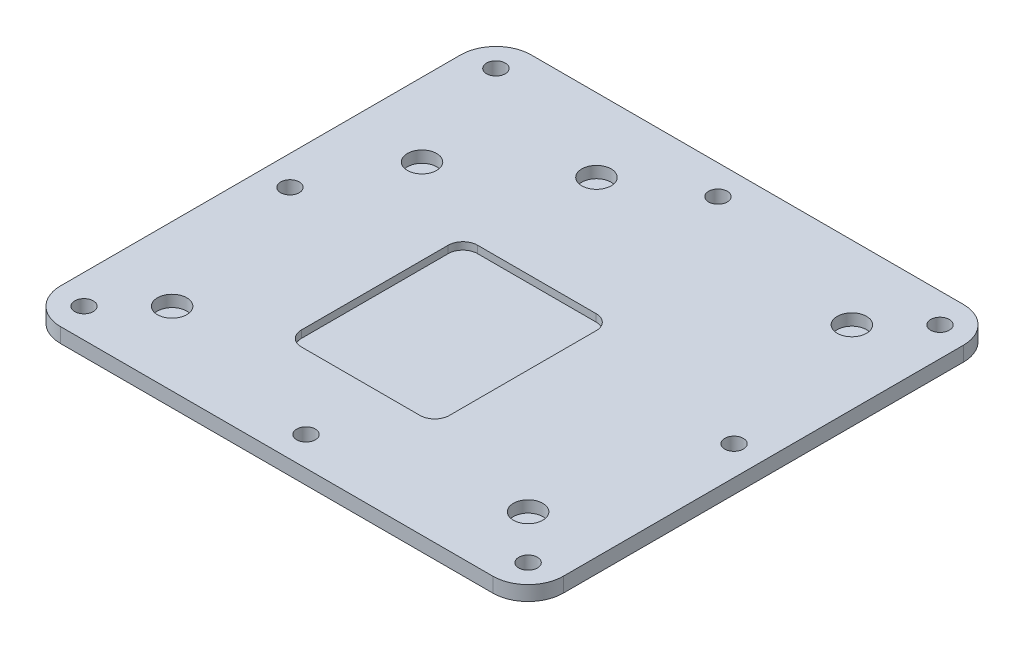
ISO-10303-21;
HEADER;
FILE_DESCRIPTION(('STEP AP214'),'2;1');
FILE_NAME('part.step','',(''),(''),'','','');
FILE_SCHEMA(('AUTOMOTIVE_DESIGN { 1 0 10303 214 1 1 1 1 }'));
ENDSEC;
DATA;
#1=APPLICATION_CONTEXT('core data for automotive mechanical design processes');
#2=APPLICATION_PROTOCOL_DEFINITION('international standard','automotive_design',2000,#1);
#3=PRODUCT_CONTEXT('',#1,'mechanical');
#4=PRODUCT('Part','Part','',(#3));
#5=PRODUCT_RELATED_PRODUCT_CATEGORY('part','',(#4));
#6=PRODUCT_DEFINITION_FORMATION('','',#4);
#7=PRODUCT_DEFINITION_CONTEXT('part definition',#1,'design');
#8=PRODUCT_DEFINITION('design','',#6,#7);
#9=PRODUCT_DEFINITION_SHAPE('','',#8);
#10=(LENGTH_UNIT() NAMED_UNIT(*) SI_UNIT(.MILLI.,.METRE.));
#11=(NAMED_UNIT(*) PLANE_ANGLE_UNIT() SI_UNIT($,.RADIAN.));
#12=(NAMED_UNIT(*) SI_UNIT($,.STERADIAN.) SOLID_ANGLE_UNIT());
#13=UNCERTAINTY_MEASURE_WITH_UNIT(LENGTH_MEASURE(1.E-05),#10,'distance_accuracy_value','');
#14=(GEOMETRIC_REPRESENTATION_CONTEXT(3) GLOBAL_UNCERTAINTY_ASSIGNED_CONTEXT((#13)) GLOBAL_UNIT_ASSIGNED_CONTEXT((#10,
#11,#12)) REPRESENTATION_CONTEXT('',''));
#15=CARTESIAN_POINT('',(0.,0.,0.));
#16=DIRECTION('',(0.,0.,1.));
#17=DIRECTION('',(1.,0.,0.));
#18=AXIS2_PLACEMENT_3D('',#15,#16,#17);
#19=CARTESIAN_POINT('',(0.,0.,0.));
#20=DIRECTION('',(0.,1.,0.));
#21=DIRECTION('',(0.,0.,1.));
#22=AXIS2_PLACEMENT_3D('',#19,#20,#21);
#23=PLANE('',#22);
#24=CARTESIAN_POINT('',(-48.006,0.,-44.5262));
#25=DIRECTION('',(0.,1.,0.));
#26=DIRECTION('',(0.,0.,1.));
#27=AXIS2_PLACEMENT_3D('',#24,#25,#26);
#28=CIRCLE('',#27,2.0193);
#29=CARTESIAN_POINT('',(-48.006,0.,-42.5069));
#30=VERTEX_POINT('',#29);
#31=EDGE_CURVE('E516',#30,#30,#28,.T.);
#32=ORIENTED_EDGE('',*,*,#31,.F.);
#33=EDGE_LOOP('',(#32));
#34=FACE_BOUND('',#33,.T.);
#35=CARTESIAN_POINT('',(48.006,0.,-44.5262));
#36=DIRECTION('',(0.,1.,0.));
#37=DIRECTION('',(0.,0.,1.));
#38=AXIS2_PLACEMENT_3D('',#35,#36,#37);
#39=CIRCLE('',#38,2.0193);
#40=CARTESIAN_POINT('',(48.006,0.,-42.5069));
#41=VERTEX_POINT('',#40);
#42=EDGE_CURVE('E511',#41,#41,#39,.T.);
#43=ORIENTED_EDGE('',*,*,#42,.F.);
#44=EDGE_LOOP('',(#43));
#45=FACE_BOUND('',#44,.T.);
#46=CARTESIAN_POINT('',(48.006,0.,44.5262));
#47=DIRECTION('',(0.,1.,0.));
#48=DIRECTION('',(0.,0.,1.));
#49=AXIS2_PLACEMENT_3D('',#46,#47,#48);
#50=CIRCLE('',#49,2.0193);
#51=CARTESIAN_POINT('',(48.006,0.,46.5455));
#52=VERTEX_POINT('',#51);
#53=EDGE_CURVE('E505',#52,#52,#50,.T.);
#54=ORIENTED_EDGE('',*,*,#53,.F.);
#55=EDGE_LOOP('',(#54));
#56=FACE_BOUND('',#55,.T.);
#57=CARTESIAN_POINT('',(-48.006,0.,44.5262));
#58=DIRECTION('',(0.,1.,0.));
#59=DIRECTION('',(0.,0.,1.));
#60=AXIS2_PLACEMENT_3D('',#57,#58,#59);
#61=CIRCLE('',#60,2.0193);
#62=CARTESIAN_POINT('',(-48.006,0.,46.5455));
#63=VERTEX_POINT('',#62);
#64=EDGE_CURVE('E499',#63,#63,#61,.T.);
#65=ORIENTED_EDGE('',*,*,#64,.F.);
#66=EDGE_LOOP('',(#65));
#67=FACE_BOUND('',#66,.T.);
#68=CARTESIAN_POINT('',(0.,0.,44.5262));
#69=DIRECTION('',(0.,1.,0.));
#70=DIRECTION('',(0.,0.,1.));
#71=AXIS2_PLACEMENT_3D('',#68,#69,#70);
#72=CIRCLE('',#71,2.0193);
#73=CARTESIAN_POINT('',(0.,0.,46.5455));
#74=VERTEX_POINT('',#73);
#75=EDGE_CURVE('E493',#74,#74,#72,.T.);
#76=ORIENTED_EDGE('',*,*,#75,.F.);
#77=EDGE_LOOP('',(#76));
#78=FACE_BOUND('',#77,.T.);
#79=CARTESIAN_POINT('',(-48.006,0.,0.));
#80=DIRECTION('',(0.,1.,0.));
#81=DIRECTION('',(0.,0.,1.));
#82=AXIS2_PLACEMENT_3D('',#79,#80,#81);
#83=CIRCLE('',#82,2.0193);
#84=CARTESIAN_POINT('',(-48.006,0.,2.0193));
#85=VERTEX_POINT('',#84);
#86=EDGE_CURVE('E487',#85,#85,#83,.T.);
#87=ORIENTED_EDGE('',*,*,#86,.F.);
#88=EDGE_LOOP('',(#87));
#89=FACE_BOUND('',#88,.T.);
#90=CARTESIAN_POINT('',(48.006,0.,0.));
#91=DIRECTION('',(0.,1.,0.));
#92=DIRECTION('',(0.,0.,1.));
#93=AXIS2_PLACEMENT_3D('',#90,#91,#92);
#94=CIRCLE('',#93,2.0193);
#95=CARTESIAN_POINT('',(48.006,0.,2.0193));
#96=VERTEX_POINT('',#95);
#97=EDGE_CURVE('E481',#96,#96,#94,.T.);
#98=ORIENTED_EDGE('',*,*,#97,.F.);
#99=EDGE_LOOP('',(#98));
#100=FACE_BOUND('',#99,.T.);
#101=CARTESIAN_POINT('',(0.,0.,-44.5262));
#102=DIRECTION('',(0.,1.,0.));
#103=DIRECTION('',(0.,0.,1.));
#104=AXIS2_PLACEMENT_3D('',#101,#102,#103);
#105=CIRCLE('',#104,2.0193);
#106=CARTESIAN_POINT('',(0.,0.,-42.5069));
#107=VERTEX_POINT('',#106);
#108=EDGE_CURVE('E475',#107,#107,#105,.T.);
#109=ORIENTED_EDGE('',*,*,#108,.F.);
#110=EDGE_LOOP('',(#109));
#111=FACE_BOUND('',#110,.T.);
#112=CARTESIAN_POINT('',(-38.481,0.,35.0012));
#113=DIRECTION('',(0.,1.,0.));
#114=DIRECTION('',(0.,0.,1.));
#115=AXIS2_PLACEMENT_3D('',#112,#113,#114);
#116=CIRCLE('',#115,3.175);
#117=CARTESIAN_POINT('',(-38.481,0.,38.1762));
#118=VERTEX_POINT('',#117);
#119=EDGE_CURVE('E449',#118,#118,#116,.T.);
#120=ORIENTED_EDGE('',*,*,#119,.F.);
#121=EDGE_LOOP('',(#120));
#122=FACE_BOUND('',#121,.T.);
#123=CARTESIAN_POINT('',(38.481,0.,35.0012));
#124=DIRECTION('',(0.,1.,0.));
#125=DIRECTION('',(0.,0.,1.));
#126=AXIS2_PLACEMENT_3D('',#123,#124,#125);
#127=CIRCLE('',#126,3.175);
#128=CARTESIAN_POINT('',(38.481,0.,38.1762));
#129=VERTEX_POINT('',#128);
#130=EDGE_CURVE('E456',#129,#129,#127,.T.);
#131=ORIENTED_EDGE('',*,*,#130,.F.);
#132=EDGE_LOOP('',(#131));
#133=FACE_BOUND('',#132,.T.);
#134=CARTESIAN_POINT('',(38.481,0.,-35.0012));
#135=DIRECTION('',(0.,1.,0.));
#136=DIRECTION('',(0.,0.,1.));
#137=AXIS2_PLACEMENT_3D('',#134,#135,#136);
#138=CIRCLE('',#137,3.175);
#139=CARTESIAN_POINT('',(38.481,0.,-31.8262));
#140=VERTEX_POINT('',#139);
#141=EDGE_CURVE('E462',#140,#140,#138,.T.);
#142=ORIENTED_EDGE('',*,*,#141,.F.);
#143=EDGE_LOOP('',(#142));
#144=FACE_BOUND('',#143,.T.);
#145=CARTESIAN_POINT('',(-16.7386,0.,-35.0012));
#146=DIRECTION('',(0.,1.,0.));
#147=DIRECTION('',(0.,0.,1.));
#148=AXIS2_PLACEMENT_3D('',#145,#146,#147);
#149=CIRCLE('',#148,3.175);
#150=CARTESIAN_POINT('',(-16.7386,0.,-31.8262));
#151=VERTEX_POINT('',#150);
#152=EDGE_CURVE('E468',#151,#151,#149,.T.);
#153=ORIENTED_EDGE('',*,*,#152,.F.);
#154=EDGE_LOOP('',(#153));
#155=FACE_BOUND('',#154,.T.);
#156=CARTESIAN_POINT('',(-38.481,0.,-19.0246));
#157=DIRECTION('',(0.,1.,0.));
#158=DIRECTION('',(0.,0.,1.));
#159=AXIS2_PLACEMENT_3D('',#156,#157,#158);
#160=CIRCLE('',#159,3.175);
#161=CARTESIAN_POINT('',(-38.481,0.,-15.8496));
#162=VERTEX_POINT('',#161);
#163=EDGE_CURVE('E443',#162,#162,#160,.T.);
#164=ORIENTED_EDGE('',*,*,#163,.F.);
#165=EDGE_LOOP('',(#164));
#166=FACE_BOUND('',#165,.T.);
#167=DIRECTION('',(-1.,0.,0.));
#168=VECTOR('',#167,1.);
#169=CARTESIAN_POINT('',(0.,0.,-50.8762));
#170=LINE('',#169,#168);
#171=CARTESIAN_POINT('',(46.736,0.,-50.8762));
#172=VERTEX_POINT('',#171);
#173=CARTESIAN_POINT('',(-46.736,0.,-50.8762));
#174=VERTEX_POINT('',#173);
#175=EDGE_CURVE('E224',#172,#174,#170,.T.);
#176=ORIENTED_EDGE('',*,*,#175,.T.);
#177=CARTESIAN_POINT('',(-46.736,0.,-43.2562));
#178=DIRECTION('',(0.,1.,0.));
#179=DIRECTION('',(0.,0.,1.));
#180=AXIS2_PLACEMENT_3D('',#177,#178,#179);
#181=CIRCLE('',#180,7.62);
#182=CARTESIAN_POINT('',(-54.356,0.,-43.2562));
#183=VERTEX_POINT('',#182);
#184=EDGE_CURVE('E231',#174,#183,#181,.T.);
#185=ORIENTED_EDGE('',*,*,#184,.T.);
#186=DIRECTION('',(0.,0.,-1.));
#187=VECTOR('',#186,1.);
#188=CARTESIAN_POINT('',(-54.356,0.,0.));
#189=LINE('',#188,#187);
#190=CARTESIAN_POINT('',(-54.356,0.,43.2562));
#191=VERTEX_POINT('',#190);
#192=EDGE_CURVE('E242',#191,#183,#189,.T.);
#193=ORIENTED_EDGE('',*,*,#192,.F.);
#194=CARTESIAN_POINT('',(-46.736,0.,43.2562));
#195=DIRECTION('',(0.,1.,0.));
#196=DIRECTION('',(0.,0.,1.));
#197=AXIS2_PLACEMENT_3D('',#194,#195,#196);
#198=CIRCLE('',#197,7.62);
#199=CARTESIAN_POINT('',(-46.736,0.,50.8762));
#200=VERTEX_POINT('',#199);
#201=EDGE_CURVE('E249',#191,#200,#198,.T.);
#202=ORIENTED_EDGE('',*,*,#201,.T.);
#203=DIRECTION('',(-1.,0.,0.));
#204=VECTOR('',#203,1.);
#205=CARTESIAN_POINT('',(0.,0.,50.8762));
#206=LINE('',#205,#204);
#207=CARTESIAN_POINT('',(46.736,0.,50.8762));
#208=VERTEX_POINT('',#207);
#209=EDGE_CURVE('E337',#208,#200,#206,.T.);
#210=ORIENTED_EDGE('',*,*,#209,.F.);
#211=CARTESIAN_POINT('',(46.736,0.,43.2562));
#212=DIRECTION('',(0.,1.,0.));
#213=DIRECTION('',(0.,0.,1.));
#214=AXIS2_PLACEMENT_3D('',#211,#212,#213);
#215=CIRCLE('',#214,7.62);
#216=CARTESIAN_POINT('',(54.356,0.,43.2562));
#217=VERTEX_POINT('',#216);
#218=EDGE_CURVE('E232',#208,#217,#215,.T.);
#219=ORIENTED_EDGE('',*,*,#218,.T.);
#220=DIRECTION('',(0.,0.,-1.));
#221=VECTOR('',#220,1.);
#222=CARTESIAN_POINT('',(54.356,0.,0.));
#223=LINE('',#222,#221);
#224=CARTESIAN_POINT('',(54.356,0.,-43.2562));
#225=VERTEX_POINT('',#224);
#226=EDGE_CURVE('E226',#217,#225,#223,.T.);
#227=ORIENTED_EDGE('',*,*,#226,.T.);
#228=CARTESIAN_POINT('',(46.736,0.,-43.2562));
#229=DIRECTION('',(0.,1.,0.));
#230=DIRECTION('',(0.,0.,1.));
#231=AXIS2_PLACEMENT_3D('',#228,#229,#230);
#232=CIRCLE('',#231,7.62);
#233=EDGE_CURVE('E222',#225,#172,#232,.T.);
#234=ORIENTED_EDGE('',*,*,#233,.T.);
#235=EDGE_LOOP('',(#176,#185,#193,#202,#210,#219,#227,#234));
#236=FACE_BOUND('',#235,.T.);
#237=DIRECTION('',(0.,0.,-1.));
#238=VECTOR('',#237,1.);
#239=CARTESIAN_POINT('',(11.938,0.,0.));
#240=LINE('',#239,#238);
#241=CARTESIAN_POINT('',(11.938,0.,25.4762));
#242=VERTEX_POINT('',#241);
#243=CARTESIAN_POINT('',(11.938,0.,-6.2738));
#244=VERTEX_POINT('',#243);
#245=EDGE_CURVE('E312',#242,#244,#240,.T.);
#246=ORIENTED_EDGE('',*,*,#245,.F.);
#247=CARTESIAN_POINT('',(8.763,0.,25.4762));
#248=DIRECTION('',(0.,1.,0.));
#249=DIRECTION('',(0.,0.,1.));
#250=AXIS2_PLACEMENT_3D('',#247,#248,#249);
#251=CIRCLE('',#250,3.175);
#252=CARTESIAN_POINT('',(8.763,0.,28.6512));
#253=VERTEX_POINT('',#252);
#254=EDGE_CURVE('E118',#242,#253,#251,.F.);
#255=ORIENTED_EDGE('',*,*,#254,.T.);
#256=DIRECTION('',(-1.,0.,0.));
#257=VECTOR('',#256,1.);
#258=CARTESIAN_POINT('',(0.,0.,28.6512));
#259=LINE('',#258,#257);
#260=CARTESIAN_POINT('',(-16.891,0.,28.6512));
#261=VERTEX_POINT('',#260);
#262=EDGE_CURVE('E323',#253,#261,#259,.T.);
#263=ORIENTED_EDGE('',*,*,#262,.T.);
#264=CARTESIAN_POINT('',(-16.891,0.,25.4762));
#265=DIRECTION('',(0.,1.,0.));
#266=DIRECTION('',(0.,0.,1.));
#267=AXIS2_PLACEMENT_3D('',#264,#265,#266);
#268=CIRCLE('',#267,3.175);
#269=CARTESIAN_POINT('',(-20.066,0.,25.4762));
#270=VERTEX_POINT('',#269);
#271=EDGE_CURVE('E12',#261,#270,#268,.F.);
#272=ORIENTED_EDGE('',*,*,#271,.T.);
#273=DIRECTION('',(0.,0.,-1.));
#274=VECTOR('',#273,1.);
#275=CARTESIAN_POINT('',(-20.066,0.,0.));
#276=LINE('',#275,#274);
#277=CARTESIAN_POINT('',(-20.066,0.,-6.2738));
#278=VERTEX_POINT('',#277);
#279=EDGE_CURVE('E345',#270,#278,#276,.T.);
#280=ORIENTED_EDGE('',*,*,#279,.T.);
#281=CARTESIAN_POINT('',(-16.891,0.,-6.2738));
#282=DIRECTION('',(0.,1.,0.));
#283=DIRECTION('',(0.,0.,1.));
#284=AXIS2_PLACEMENT_3D('',#281,#282,#283);
#285=CIRCLE('',#284,3.175);
#286=CARTESIAN_POINT('',(-16.891,0.,-9.4488));
#287=VERTEX_POINT('',#286);
#288=EDGE_CURVE('E307',#278,#287,#285,.F.);
#289=ORIENTED_EDGE('',*,*,#288,.T.);
#290=DIRECTION('',(-1.,0.,0.));
#291=VECTOR('',#290,1.);
#292=CARTESIAN_POINT('',(0.,0.,-9.4488));
#293=LINE('',#292,#291);
#294=CARTESIAN_POINT('',(8.763,0.,-9.4488));
#295=VERTEX_POINT('',#294);
#296=EDGE_CURVE('E314',#295,#287,#293,.T.);
#297=ORIENTED_EDGE('',*,*,#296,.F.);
#298=CARTESIAN_POINT('',(8.763,0.,-6.2738));
#299=DIRECTION('',(0.,1.,0.));
#300=DIRECTION('',(0.,0.,1.));
#301=AXIS2_PLACEMENT_3D('',#298,#299,#300);
#302=CIRCLE('',#301,3.175);
#303=EDGE_CURVE('E309',#295,#244,#302,.F.);
#304=ORIENTED_EDGE('',*,*,#303,.T.);
#305=EDGE_LOOP('',(#246,#255,#263,#272,#280,#289,#297,#304));
#306=FACE_BOUND('',#305,.T.);
#307=ADVANCED_FACE('F110',(#34,#45,#56,#67,#78,#89,#100,#111,#122,#133,#144,#155,#166,#236,
#306),#23,.T.);
#308=CARTESIAN_POINT('',(0.,-3.175,0.));
#309=DIRECTION('',(0.,1.,0.));
#310=DIRECTION('',(0.,0.,1.));
#311=AXIS2_PLACEMENT_3D('',#308,#309,#310);
#312=PLANE('',#311);
#313=CARTESIAN_POINT('',(-48.006,-3.175,-44.5262));
#314=DIRECTION('',(0.,1.,0.));
#315=DIRECTION('',(0.,0.,1.));
#316=AXIS2_PLACEMENT_3D('',#313,#314,#315);
#317=CIRCLE('',#316,2.0193);
#318=CARTESIAN_POINT('',(-48.006,-3.175,-42.5069));
#319=VERTEX_POINT('',#318);
#320=EDGE_CURVE('E514',#319,#319,#317,.T.);
#321=ORIENTED_EDGE('',*,*,#320,.T.);
#322=EDGE_LOOP('',(#321));
#323=FACE_BOUND('',#322,.T.);
#324=CARTESIAN_POINT('',(48.006,-3.175,-44.5262));
#325=DIRECTION('',(0.,1.,0.));
#326=DIRECTION('',(0.,0.,1.));
#327=AXIS2_PLACEMENT_3D('',#324,#325,#326);
#328=CIRCLE('',#327,2.0193);
#329=CARTESIAN_POINT('',(48.006,-3.175,-42.5069));
#330=VERTEX_POINT('',#329);
#331=EDGE_CURVE('E508',#330,#330,#328,.T.);
#332=ORIENTED_EDGE('',*,*,#331,.T.);
#333=EDGE_LOOP('',(#332));
#334=FACE_BOUND('',#333,.T.);
#335=CARTESIAN_POINT('',(48.006,-3.175,44.5262));
#336=DIRECTION('',(0.,1.,0.));
#337=DIRECTION('',(0.,0.,1.));
#338=AXIS2_PLACEMENT_3D('',#335,#336,#337);
#339=CIRCLE('',#338,2.0193);
#340=CARTESIAN_POINT('',(48.006,-3.175,46.5455));
#341=VERTEX_POINT('',#340);
#342=EDGE_CURVE('E502',#341,#341,#339,.T.);
#343=ORIENTED_EDGE('',*,*,#342,.T.);
#344=EDGE_LOOP('',(#343));
#345=FACE_BOUND('',#344,.T.);
#346=CARTESIAN_POINT('',(-48.006,-3.175,44.5262));
#347=DIRECTION('',(0.,1.,0.));
#348=DIRECTION('',(0.,0.,1.));
#349=AXIS2_PLACEMENT_3D('',#346,#347,#348);
#350=CIRCLE('',#349,2.0193);
#351=CARTESIAN_POINT('',(-48.006,-3.175,46.5455));
#352=VERTEX_POINT('',#351);
#353=EDGE_CURVE('E496',#352,#352,#350,.T.);
#354=ORIENTED_EDGE('',*,*,#353,.T.);
#355=EDGE_LOOP('',(#354));
#356=FACE_BOUND('',#355,.T.);
#357=CARTESIAN_POINT('',(0.,-3.175,44.5262));
#358=DIRECTION('',(0.,1.,0.));
#359=DIRECTION('',(0.,0.,1.));
#360=AXIS2_PLACEMENT_3D('',#357,#358,#359);
#361=CIRCLE('',#360,2.0193);
#362=CARTESIAN_POINT('',(0.,-3.175,46.5455));
#363=VERTEX_POINT('',#362);
#364=EDGE_CURVE('E490',#363,#363,#361,.T.);
#365=ORIENTED_EDGE('',*,*,#364,.T.);
#366=EDGE_LOOP('',(#365));
#367=FACE_BOUND('',#366,.T.);
#368=CARTESIAN_POINT('',(-48.006,-3.175,0.));
#369=DIRECTION('',(0.,1.,0.));
#370=DIRECTION('',(0.,0.,1.));
#371=AXIS2_PLACEMENT_3D('',#368,#369,#370);
#372=CIRCLE('',#371,2.0193);
#373=CARTESIAN_POINT('',(-48.006,-3.175,2.0193));
#374=VERTEX_POINT('',#373);
#375=EDGE_CURVE('E484',#374,#374,#372,.T.);
#376=ORIENTED_EDGE('',*,*,#375,.T.);
#377=EDGE_LOOP('',(#376));
#378=FACE_BOUND('',#377,.T.);
#379=CARTESIAN_POINT('',(48.006,-3.175,0.));
#380=DIRECTION('',(0.,1.,0.));
#381=DIRECTION('',(0.,0.,1.));
#382=AXIS2_PLACEMENT_3D('',#379,#380,#381);
#383=CIRCLE('',#382,2.0193);
#384=CARTESIAN_POINT('',(48.006,-3.175,2.0193));
#385=VERTEX_POINT('',#384);
#386=EDGE_CURVE('E478',#385,#385,#383,.T.);
#387=ORIENTED_EDGE('',*,*,#386,.T.);
#388=EDGE_LOOP('',(#387));
#389=FACE_BOUND('',#388,.T.);
#390=CARTESIAN_POINT('',(0.,-3.175,-44.5262));
#391=DIRECTION('',(0.,1.,0.));
#392=DIRECTION('',(0.,0.,1.));
#393=AXIS2_PLACEMENT_3D('',#390,#391,#392);
#394=CIRCLE('',#393,2.0193);
#395=CARTESIAN_POINT('',(0.,-3.175,-42.5069));
#396=VERTEX_POINT('',#395);
#397=EDGE_CURVE('E453',#396,#396,#394,.T.);
#398=ORIENTED_EDGE('',*,*,#397,.T.);
#399=EDGE_LOOP('',(#398));
#400=FACE_BOUND('',#399,.T.);
#401=DIRECTION('',(0.,0.,-1.));
#402=VECTOR('',#401,1.);
#403=CARTESIAN_POINT('',(-54.356,-3.175,0.));
#404=LINE('',#403,#402);
#405=CARTESIAN_POINT('',(-54.356,-3.175,43.2562));
#406=VERTEX_POINT('',#405);
#407=CARTESIAN_POINT('',(-54.356,-3.175,-43.2562));
#408=VERTEX_POINT('',#407);
#409=EDGE_CURVE('E247',#406,#408,#404,.T.);
#410=ORIENTED_EDGE('',*,*,#409,.T.);
#411=CARTESIAN_POINT('',(-46.736,-3.175,-43.2562));
#412=DIRECTION('',(0.,1.,0.));
#413=DIRECTION('',(0.,0.,1.));
#414=AXIS2_PLACEMENT_3D('',#411,#412,#413);
#415=CIRCLE('',#414,7.62);
#416=CARTESIAN_POINT('',(-46.736,-3.175,-50.8762));
#417=VERTEX_POINT('',#416);
#418=EDGE_CURVE('E269',#408,#417,#415,.F.);
#419=ORIENTED_EDGE('',*,*,#418,.T.);
#420=DIRECTION('',(-1.,0.,0.));
#421=VECTOR('',#420,1.);
#422=CARTESIAN_POINT('',(0.,-3.175,-50.8762));
#423=LINE('',#422,#421);
#424=CARTESIAN_POINT('',(46.736,-3.175,-50.8762));
#425=VERTEX_POINT('',#424);
#426=EDGE_CURVE('E252',#425,#417,#423,.T.);
#427=ORIENTED_EDGE('',*,*,#426,.F.);
#428=CARTESIAN_POINT('',(46.736,-3.175,-43.2562));
#429=DIRECTION('',(0.,1.,0.));
#430=DIRECTION('',(0.,0.,1.));
#431=AXIS2_PLACEMENT_3D('',#428,#429,#430);
#432=CIRCLE('',#431,7.62);
#433=CARTESIAN_POINT('',(54.356,-3.175,-43.2562));
#434=VERTEX_POINT('',#433);
#435=EDGE_CURVE('E246',#425,#434,#432,.F.);
#436=ORIENTED_EDGE('',*,*,#435,.T.);
#437=DIRECTION('',(0.,0.,-1.));
#438=VECTOR('',#437,1.);
#439=CARTESIAN_POINT('',(54.356,-3.175,0.));
#440=LINE('',#439,#438);
#441=CARTESIAN_POINT('',(54.356,-3.175,43.2562));
#442=VERTEX_POINT('',#441);
#443=EDGE_CURVE('E355',#442,#434,#440,.T.);
#444=ORIENTED_EDGE('',*,*,#443,.F.);
#445=CARTESIAN_POINT('',(46.736,-3.175,43.2562));
#446=DIRECTION('',(0.,1.,0.));
#447=DIRECTION('',(0.,0.,1.));
#448=AXIS2_PLACEMENT_3D('',#445,#446,#447);
#449=CIRCLE('',#448,7.62);
#450=CARTESIAN_POINT('',(46.736,-3.175,50.8762));
#451=VERTEX_POINT('',#450);
#452=EDGE_CURVE('E266',#442,#451,#449,.F.);
#453=ORIENTED_EDGE('',*,*,#452,.T.);
#454=DIRECTION('',(-1.,0.,0.));
#455=VECTOR('',#454,1.);
#456=CARTESIAN_POINT('',(0.,-3.175,50.8762));
#457=LINE('',#456,#455);
#458=CARTESIAN_POINT('',(-46.736,-3.175,50.8762));
#459=VERTEX_POINT('',#458);
#460=EDGE_CURVE('E352',#451,#459,#457,.T.);
#461=ORIENTED_EDGE('',*,*,#460,.T.);
#462=CARTESIAN_POINT('',(-46.736,-3.175,43.2562));
#463=DIRECTION('',(0.,1.,0.));
#464=DIRECTION('',(0.,0.,1.));
#465=AXIS2_PLACEMENT_3D('',#462,#463,#464);
#466=CIRCLE('',#465,7.62);
#467=EDGE_CURVE('E264',#459,#406,#466,.F.);
#468=ORIENTED_EDGE('',*,*,#467,.T.);
#469=EDGE_LOOP('',(#410,#419,#427,#436,#444,#453,#461,#468));
#470=FACE_BOUND('',#469,.T.);
#471=ADVANCED_FACE('F386',(#323,#334,#345,#356,#367,#378,#389,#400,#470),#312,.F.);
#472=CARTESIAN_POINT('',(-54.356,-3.175,0.));
#473=DIRECTION('',(1.,0.,0.));
#474=DIRECTION('',(0.,0.,-1.));
#475=AXIS2_PLACEMENT_3D('',#472,#473,#474);
#476=PLANE('',#475);
#477=ORIENTED_EDGE('',*,*,#192,.T.);
#478=DIRECTION('',(0.,1.,0.));
#479=VECTOR('',#478,1.);
#480=CARTESIAN_POINT('',(-54.356,-3.175,-43.2562));
#481=LINE('',#480,#479);
#482=EDGE_CURVE('E262',#183,#408,#481,.F.);
#483=ORIENTED_EDGE('',*,*,#482,.T.);
#484=ORIENTED_EDGE('',*,*,#409,.F.);
#485=DIRECTION('',(0.,1.,0.));
#486=VECTOR('',#485,1.);
#487=CARTESIAN_POINT('',(-54.356,-3.175,43.2562));
#488=LINE('',#487,#486);
#489=EDGE_CURVE('E259',#406,#191,#488,.T.);
#490=ORIENTED_EDGE('',*,*,#489,.T.);
#491=EDGE_LOOP('',(#477,#483,#484,#490));
#492=FACE_BOUND('',#491,.T.);
#493=ADVANCED_FACE('F367',(#492),#476,.F.);
#494=CARTESIAN_POINT('',(0.,-3.175,-50.8762));
#495=DIRECTION('',(0.,0.,-1.));
#496=DIRECTION('',(-1.,0.,0.));
#497=AXIS2_PLACEMENT_3D('',#494,#495,#496);
#498=PLANE('',#497);
#499=ORIENTED_EDGE('',*,*,#426,.T.);
#500=DIRECTION('',(0.,1.,0.));
#501=VECTOR('',#500,1.);
#502=CARTESIAN_POINT('',(-46.736,0.,-50.8762));
#503=LINE('',#502,#501);
#504=EDGE_CURVE('E241',#417,#174,#503,.T.);
#505=ORIENTED_EDGE('',*,*,#504,.T.);
#506=ORIENTED_EDGE('',*,*,#175,.F.);
#507=DIRECTION('',(0.,1.,0.));
#508=VECTOR('',#507,1.);
#509=CARTESIAN_POINT('',(46.736,-3.175,-50.8762));
#510=LINE('',#509,#508);
#511=EDGE_CURVE('E238',#172,#425,#510,.F.);
#512=ORIENTED_EDGE('',*,*,#511,.T.);
#513=EDGE_LOOP('',(#499,#505,#506,#512));
#514=FACE_BOUND('',#513,.T.);
#515=ADVANCED_FACE('F237',(#514),#498,.T.);
#516=CARTESIAN_POINT('',(54.356,-3.175,0.));
#517=DIRECTION('',(1.,0.,0.));
#518=DIRECTION('',(0.,0.,-1.));
#519=AXIS2_PLACEMENT_3D('',#516,#517,#518);
#520=PLANE('',#519);
#521=ORIENTED_EDGE('',*,*,#443,.T.);
#522=DIRECTION('',(0.,1.,0.));
#523=VECTOR('',#522,1.);
#524=CARTESIAN_POINT('',(54.356,-3.175,-43.2562));
#525=LINE('',#524,#523);
#526=EDGE_CURVE('E273',#434,#225,#525,.T.);
#527=ORIENTED_EDGE('',*,*,#526,.T.);
#528=ORIENTED_EDGE('',*,*,#226,.F.);
#529=DIRECTION('',(0.,1.,0.));
#530=VECTOR('',#529,1.);
#531=CARTESIAN_POINT('',(54.356,-3.175,43.2562));
#532=LINE('',#531,#530);
#533=EDGE_CURVE('E271',#217,#442,#532,.F.);
#534=ORIENTED_EDGE('',*,*,#533,.T.);
#535=EDGE_LOOP('',(#521,#527,#528,#534));
#536=FACE_BOUND('',#535,.T.);
#537=ADVANCED_FACE('F384',(#536),#520,.T.);
#538=CARTESIAN_POINT('',(0.,-3.175,50.8762));
#539=DIRECTION('',(0.,0.,-1.));
#540=DIRECTION('',(-1.,0.,0.));
#541=AXIS2_PLACEMENT_3D('',#538,#539,#540);
#542=PLANE('',#541);
#543=ORIENTED_EDGE('',*,*,#460,.F.);
#544=DIRECTION('',(0.,1.,0.));
#545=VECTOR('',#544,1.);
#546=CARTESIAN_POINT('',(46.736,0.,50.8762));
#547=LINE('',#546,#545);
#548=EDGE_CURVE('E277',#451,#208,#547,.T.);
#549=ORIENTED_EDGE('',*,*,#548,.T.);
#550=ORIENTED_EDGE('',*,*,#209,.T.);
#551=DIRECTION('',(0.,1.,0.));
#552=VECTOR('',#551,1.);
#553=CARTESIAN_POINT('',(-46.736,-3.175,50.8762));
#554=LINE('',#553,#552);
#555=EDGE_CURVE('E275',#200,#459,#554,.F.);
#556=ORIENTED_EDGE('',*,*,#555,.T.);
#557=EDGE_LOOP('',(#543,#549,#550,#556));
#558=FACE_BOUND('',#557,.T.);
#559=ADVANCED_FACE('F377',(#558),#542,.F.);
#560=CARTESIAN_POINT('',(-20.066,-1.5875,0.));
#561=DIRECTION('',(1.,0.,0.));
#562=DIRECTION('',(0.,0.,-1.));
#563=AXIS2_PLACEMENT_3D('',#560,#561,#562);
#564=PLANE('',#563);
#565=DIRECTION('',(0.,0.,-1.));
#566=VECTOR('',#565,1.);
#567=CARTESIAN_POINT('',(-20.066,-1.5875,0.));
#568=LINE('',#567,#566);
#569=CARTESIAN_POINT('',(-20.066,-1.5875,25.4762));
#570=VERTEX_POINT('',#569);
#571=CARTESIAN_POINT('',(-20.066,-1.5875,-6.2738));
#572=VERTEX_POINT('',#571);
#573=EDGE_CURVE('E351',#570,#572,#568,.T.);
#574=ORIENTED_EDGE('',*,*,#573,.T.);
#575=DIRECTION('',(0.,1.,0.));
#576=VECTOR('',#575,1.);
#577=CARTESIAN_POINT('',(-20.066,-1.5875,-6.2738));
#578=LINE('',#577,#576);
#579=EDGE_CURVE('E282',#572,#278,#578,.T.);
#580=ORIENTED_EDGE('',*,*,#579,.T.);
#581=ORIENTED_EDGE('',*,*,#279,.F.);
#582=DIRECTION('',(0.,1.,0.));
#583=VECTOR('',#582,1.);
#584=CARTESIAN_POINT('',(-20.066,-1.5875,25.4762));
#585=LINE('',#584,#583);
#586=EDGE_CURVE('E280',#270,#570,#585,.F.);
#587=ORIENTED_EDGE('',*,*,#586,.T.);
#588=EDGE_LOOP('',(#574,#580,#581,#587));
#589=FACE_BOUND('',#588,.T.);
#590=ADVANCED_FACE('F390',(#589),#564,.T.);
#591=CARTESIAN_POINT('',(0.,-1.5875,-9.4488));
#592=DIRECTION('',(0.,0.,-1.));
#593=DIRECTION('',(-1.,0.,0.));
#594=AXIS2_PLACEMENT_3D('',#591,#592,#593);
#595=PLANE('',#594);
#596=ORIENTED_EDGE('',*,*,#296,.T.);
#597=DIRECTION('',(0.,1.,0.));
#598=VECTOR('',#597,1.);
#599=CARTESIAN_POINT('',(-16.891,-1.5875,-9.4488));
#600=LINE('',#599,#598);
#601=CARTESIAN_POINT('',(-16.891,-1.5875,-9.4488));
#602=VERTEX_POINT('',#601);
#603=EDGE_CURVE('E288',#287,#602,#600,.F.);
#604=ORIENTED_EDGE('',*,*,#603,.T.);
#605=DIRECTION('',(-1.,0.,0.));
#606=VECTOR('',#605,1.);
#607=CARTESIAN_POINT('',(0.,-1.5875,-9.4488));
#608=LINE('',#607,#606);
#609=CARTESIAN_POINT('',(8.763,-1.5875,-9.4488));
#610=VERTEX_POINT('',#609);
#611=EDGE_CURVE('E331',#610,#602,#608,.T.);
#612=ORIENTED_EDGE('',*,*,#611,.F.);
#613=DIRECTION('',(0.,1.,0.));
#614=VECTOR('',#613,1.);
#615=CARTESIAN_POINT('',(8.763,0.,-9.4488));
#616=LINE('',#615,#614);
#617=EDGE_CURVE('E285',#610,#295,#616,.T.);
#618=ORIENTED_EDGE('',*,*,#617,.T.);
#619=EDGE_LOOP('',(#596,#604,#612,#618));
#620=FACE_BOUND('',#619,.T.);
#621=ADVANCED_FACE('F335',(#620),#595,.F.);
#622=CARTESIAN_POINT('',(11.938,-1.5875,0.));
#623=DIRECTION('',(1.,0.,0.));
#624=DIRECTION('',(0.,0.,-1.));
#625=AXIS2_PLACEMENT_3D('',#622,#623,#624);
#626=PLANE('',#625);
#627=ORIENTED_EDGE('',*,*,#245,.T.);
#628=DIRECTION('',(0.,1.,0.));
#629=VECTOR('',#628,1.);
#630=CARTESIAN_POINT('',(11.938,-1.5875,-6.2738));
#631=LINE('',#630,#629);
#632=CARTESIAN_POINT('',(11.938,-1.5875,-6.2738));
#633=VERTEX_POINT('',#632);
#634=EDGE_CURVE('E301',#244,#633,#631,.F.);
#635=ORIENTED_EDGE('',*,*,#634,.T.);
#636=DIRECTION('',(0.,0.,-1.));
#637=VECTOR('',#636,1.);
#638=CARTESIAN_POINT('',(11.938,-1.5875,0.));
#639=LINE('',#638,#637);
#640=CARTESIAN_POINT('',(11.938,-1.5875,25.4762));
#641=VERTEX_POINT('',#640);
#642=EDGE_CURVE('E333',#641,#633,#639,.T.);
#643=ORIENTED_EDGE('',*,*,#642,.F.);
#644=DIRECTION('',(0.,1.,0.));
#645=VECTOR('',#644,1.);
#646=CARTESIAN_POINT('',(11.938,-1.5875,25.4762));
#647=LINE('',#646,#645);
#648=EDGE_CURVE('E298',#641,#242,#647,.T.);
#649=ORIENTED_EDGE('',*,*,#648,.T.);
#650=EDGE_LOOP('',(#627,#635,#643,#649));
#651=FACE_BOUND('',#650,.T.);
#652=ADVANCED_FACE('F319',(#651),#626,.F.);
#653=CARTESIAN_POINT('',(0.,-1.5875,28.6512));
#654=DIRECTION('',(0.,0.,-1.));
#655=DIRECTION('',(-1.,0.,0.));
#656=AXIS2_PLACEMENT_3D('',#653,#654,#655);
#657=PLANE('',#656);
#658=ORIENTED_EDGE('',*,*,#262,.F.);
#659=DIRECTION('',(0.,1.,0.));
#660=VECTOR('',#659,1.);
#661=CARTESIAN_POINT('',(8.763,-1.5875,28.6512));
#662=LINE('',#661,#660);
#663=CARTESIAN_POINT('',(8.763,-1.5875,28.6512));
#664=VERTEX_POINT('',#663);
#665=EDGE_CURVE('E305',#253,#664,#662,.F.);
#666=ORIENTED_EDGE('',*,*,#665,.T.);
#667=DIRECTION('',(-1.,0.,0.));
#668=VECTOR('',#667,1.);
#669=CARTESIAN_POINT('',(0.,-1.5875,28.6512));
#670=LINE('',#669,#668);
#671=CARTESIAN_POINT('',(-16.891,-1.5875,28.6512));
#672=VERTEX_POINT('',#671);
#673=EDGE_CURVE('E341',#664,#672,#670,.T.);
#674=ORIENTED_EDGE('',*,*,#673,.T.);
#675=DIRECTION('',(0.,1.,0.));
#676=VECTOR('',#675,1.);
#677=CARTESIAN_POINT('',(-16.891,0.,28.6512));
#678=LINE('',#677,#676);
#679=EDGE_CURVE('E303',#672,#261,#678,.T.);
#680=ORIENTED_EDGE('',*,*,#679,.T.);
#681=EDGE_LOOP('',(#658,#666,#674,#680));
#682=FACE_BOUND('',#681,.T.);
#683=ADVANCED_FACE('F557',(#682),#657,.T.);
#684=CARTESIAN_POINT('',(0.,-1.5875,0.));
#685=DIRECTION('',(0.,1.,0.));
#686=DIRECTION('',(0.,0.,1.));
#687=AXIS2_PLACEMENT_3D('',#684,#685,#686);
#688=PLANE('',#687);
#689=ORIENTED_EDGE('',*,*,#611,.T.);
#690=CARTESIAN_POINT('',(-16.891,-1.5875,-6.2738));
#691=DIRECTION('',(0.,1.,0.));
#692=DIRECTION('',(0.,0.,1.));
#693=AXIS2_PLACEMENT_3D('',#690,#691,#692);
#694=CIRCLE('',#693,3.175);
#695=EDGE_CURVE('E296',#602,#572,#694,.T.);
#696=ORIENTED_EDGE('',*,*,#695,.T.);
#697=ORIENTED_EDGE('',*,*,#573,.F.);
#698=CARTESIAN_POINT('',(-16.891,-1.5875,25.4762));
#699=DIRECTION('',(0.,1.,0.));
#700=DIRECTION('',(0.,0.,1.));
#701=AXIS2_PLACEMENT_3D('',#698,#699,#700);
#702=CIRCLE('',#701,3.175);
#703=EDGE_CURVE('E290',#570,#672,#702,.T.);
#704=ORIENTED_EDGE('',*,*,#703,.T.);
#705=ORIENTED_EDGE('',*,*,#673,.F.);
#706=CARTESIAN_POINT('',(8.763,-1.5875,25.4762));
#707=DIRECTION('',(0.,1.,0.));
#708=DIRECTION('',(0.,0.,1.));
#709=AXIS2_PLACEMENT_3D('',#706,#707,#708);
#710=CIRCLE('',#709,3.175);
#711=EDGE_CURVE('E292',#664,#641,#710,.T.);
#712=ORIENTED_EDGE('',*,*,#711,.T.);
#713=ORIENTED_EDGE('',*,*,#642,.T.);
#714=CARTESIAN_POINT('',(8.763,-1.5875,-6.2738));
#715=DIRECTION('',(0.,1.,0.));
#716=DIRECTION('',(0.,0.,1.));
#717=AXIS2_PLACEMENT_3D('',#714,#715,#716);
#718=CIRCLE('',#717,3.175);
#719=EDGE_CURVE('E294',#633,#610,#718,.T.);
#720=ORIENTED_EDGE('',*,*,#719,.T.);
#721=EDGE_LOOP('',(#689,#696,#697,#704,#705,#712,#713,#720));
#722=FACE_BOUND('',#721,.T.);
#723=ADVANCED_FACE('F330',(#722),#688,.T.);
#724=CARTESIAN_POINT('',(-38.481,-2.5,-19.0246));
#725=DIRECTION('',(0.,1.,0.));
#726=DIRECTION('',(0.,0.,1.));
#727=AXIS2_PLACEMENT_3D('',#724,#725,#726);
#728=CYLINDRICAL_SURFACE('',#727,3.175);
#729=CARTESIAN_POINT('',(-38.481,-2.5,-19.0246));
#730=DIRECTION('',(0.,1.,0.));
#731=DIRECTION('',(0.,0.,1.));
#732=AXIS2_PLACEMENT_3D('',#729,#730,#731);
#733=CIRCLE('',#732,3.175);
#734=CARTESIAN_POINT('',(-38.481,-2.5,-15.8496));
#735=VERTEX_POINT('',#734);
#736=EDGE_CURVE('E348',#735,#735,#733,.T.);
#737=ORIENTED_EDGE('',*,*,#736,.F.);
#738=EDGE_LOOP('',(#737));
#739=FACE_BOUND('',#738,.T.);
#740=ORIENTED_EDGE('',*,*,#163,.T.);
#741=EDGE_LOOP('',(#740));
#742=FACE_BOUND('',#741,.T.);
#743=ADVANCED_FACE('F545',(#739,#742),#728,.F.);
#744=CARTESIAN_POINT('',(-38.481,-2.5,-19.0246));
#745=DIRECTION('',(0.,1.,0.));
#746=DIRECTION('',(0.,0.,1.));
#747=AXIS2_PLACEMENT_3D('',#744,#745,#746);
#748=PLANE('',#747);
#749=ORIENTED_EDGE('',*,*,#736,.T.);
#750=EDGE_LOOP('',(#749));
#751=FACE_BOUND('',#750,.T.);
#752=ADVANCED_FACE('F547',(#751),#748,.T.);
#753=CARTESIAN_POINT('',(-16.7386,-2.5,-35.0012));
#754=DIRECTION('',(0.,1.,0.));
#755=DIRECTION('',(0.,0.,1.));
#756=AXIS2_PLACEMENT_3D('',#753,#754,#755);
#757=CYLINDRICAL_SURFACE('',#756,3.175);
#758=CARTESIAN_POINT('',(-16.7386,-2.5,-35.0012));
#759=DIRECTION('',(0.,1.,0.));
#760=DIRECTION('',(0.,0.,1.));
#761=AXIS2_PLACEMENT_3D('',#758,#759,#760);
#762=CIRCLE('',#761,3.175);
#763=CARTESIAN_POINT('',(-16.7386,-2.5,-31.8262));
#764=VERTEX_POINT('',#763);
#765=EDGE_CURVE('E446',#764,#764,#762,.T.);
#766=ORIENTED_EDGE('',*,*,#765,.F.);
#767=EDGE_LOOP('',(#766));
#768=FACE_BOUND('',#767,.T.);
#769=ORIENTED_EDGE('',*,*,#152,.T.);
#770=EDGE_LOOP('',(#769));
#771=FACE_BOUND('',#770,.T.);
#772=ADVANCED_FACE('F554',(#768,#771),#757,.F.);
#773=CARTESIAN_POINT('',(-16.7386,-2.5,-35.0012));
#774=DIRECTION('',(0.,1.,0.));
#775=DIRECTION('',(0.,0.,1.));
#776=AXIS2_PLACEMENT_3D('',#773,#774,#775);
#777=PLANE('',#776);
#778=ORIENTED_EDGE('',*,*,#765,.T.);
#779=EDGE_LOOP('',(#778));
#780=FACE_BOUND('',#779,.T.);
#781=ADVANCED_FACE('F728',(#780),#777,.T.);
#782=CARTESIAN_POINT('',(38.481,-2.5,-35.0012));
#783=DIRECTION('',(0.,1.,0.));
#784=DIRECTION('',(0.,0.,1.));
#785=AXIS2_PLACEMENT_3D('',#782,#783,#784);
#786=CYLINDRICAL_SURFACE('',#785,3.175);
#787=CARTESIAN_POINT('',(38.481,-2.5,-35.0012));
#788=DIRECTION('',(0.,1.,0.));
#789=DIRECTION('',(0.,0.,1.));
#790=AXIS2_PLACEMENT_3D('',#787,#788,#789);
#791=CIRCLE('',#790,3.175);
#792=CARTESIAN_POINT('',(38.481,-2.5,-31.8262));
#793=VERTEX_POINT('',#792);
#794=EDGE_CURVE('E465',#793,#793,#791,.T.);
#795=ORIENTED_EDGE('',*,*,#794,.F.);
#796=EDGE_LOOP('',(#795));
#797=FACE_BOUND('',#796,.T.);
#798=ORIENTED_EDGE('',*,*,#141,.T.);
#799=EDGE_LOOP('',(#798));
#800=FACE_BOUND('',#799,.T.);
#801=ADVANCED_FACE('F720',(#797,#800),#786,.F.);
#802=CARTESIAN_POINT('',(38.481,-2.5,-35.0012));
#803=DIRECTION('',(0.,1.,0.));
#804=DIRECTION('',(0.,0.,1.));
#805=AXIS2_PLACEMENT_3D('',#802,#803,#804);
#806=PLANE('',#805);
#807=ORIENTED_EDGE('',*,*,#794,.T.);
#808=EDGE_LOOP('',(#807));
#809=FACE_BOUND('',#808,.T.);
#810=ADVANCED_FACE('F712',(#809),#806,.T.);
#811=CARTESIAN_POINT('',(38.481,-2.5,35.0012));
#812=DIRECTION('',(0.,1.,0.));
#813=DIRECTION('',(0.,0.,1.));
#814=AXIS2_PLACEMENT_3D('',#811,#812,#813);
#815=CYLINDRICAL_SURFACE('',#814,3.175);
#816=CARTESIAN_POINT('',(38.481,-2.5,35.0012));
#817=DIRECTION('',(0.,1.,0.));
#818=DIRECTION('',(0.,0.,1.));
#819=AXIS2_PLACEMENT_3D('',#816,#817,#818);
#820=CIRCLE('',#819,3.175);
#821=CARTESIAN_POINT('',(38.481,-2.5,38.1762));
#822=VERTEX_POINT('',#821);
#823=EDGE_CURVE('E459',#822,#822,#820,.T.);
#824=ORIENTED_EDGE('',*,*,#823,.F.);
#825=EDGE_LOOP('',(#824));
#826=FACE_BOUND('',#825,.T.);
#827=ORIENTED_EDGE('',*,*,#130,.T.);
#828=EDGE_LOOP('',(#827));
#829=FACE_BOUND('',#828,.T.);
#830=ADVANCED_FACE('F704',(#826,#829),#815,.F.);
#831=CARTESIAN_POINT('',(38.481,-2.5,35.0012));
#832=DIRECTION('',(0.,1.,0.));
#833=DIRECTION('',(0.,0.,1.));
#834=AXIS2_PLACEMENT_3D('',#831,#832,#833);
#835=PLANE('',#834);
#836=ORIENTED_EDGE('',*,*,#823,.T.);
#837=EDGE_LOOP('',(#836));
#838=FACE_BOUND('',#837,.T.);
#839=ADVANCED_FACE('F697',(#838),#835,.T.);
#840=CARTESIAN_POINT('',(-38.481,-2.5,35.0012));
#841=DIRECTION('',(0.,1.,0.));
#842=DIRECTION('',(0.,0.,1.));
#843=AXIS2_PLACEMENT_3D('',#840,#841,#842);
#844=CYLINDRICAL_SURFACE('',#843,3.175);
#845=CARTESIAN_POINT('',(-38.481,-2.5,35.0012));
#846=DIRECTION('',(0.,1.,0.));
#847=DIRECTION('',(0.,0.,1.));
#848=AXIS2_PLACEMENT_3D('',#845,#846,#847);
#849=CIRCLE('',#848,3.175);
#850=CARTESIAN_POINT('',(-38.481,-2.5,38.1762));
#851=VERTEX_POINT('',#850);
#852=EDGE_CURVE('E452',#851,#851,#849,.T.);
#853=ORIENTED_EDGE('',*,*,#852,.F.);
#854=EDGE_LOOP('',(#853));
#855=FACE_BOUND('',#854,.T.);
#856=ORIENTED_EDGE('',*,*,#119,.T.);
#857=EDGE_LOOP('',(#856));
#858=FACE_BOUND('',#857,.T.);
#859=ADVANCED_FACE('F688',(#855,#858),#844,.F.);
#860=CARTESIAN_POINT('',(-38.481,-2.5,35.0012));
#861=DIRECTION('',(0.,1.,0.));
#862=DIRECTION('',(0.,0.,1.));
#863=AXIS2_PLACEMENT_3D('',#860,#861,#862);
#864=PLANE('',#863);
#865=ORIENTED_EDGE('',*,*,#852,.T.);
#866=EDGE_LOOP('',(#865));
#867=FACE_BOUND('',#866,.T.);
#868=ADVANCED_FACE('F413',(#867),#864,.T.);
#869=CARTESIAN_POINT('',(-46.736,-3.175,-43.2562));
#870=DIRECTION('',(0.,-1.,0.));
#871=DIRECTION('',(0.,0.,-1.));
#872=AXIS2_PLACEMENT_3D('',#869,#870,#871);
#873=CYLINDRICAL_SURFACE('',#872,7.62);
#874=ORIENTED_EDGE('',*,*,#418,.F.);
#875=ORIENTED_EDGE('',*,*,#482,.F.);
#876=ORIENTED_EDGE('',*,*,#184,.F.);
#877=ORIENTED_EDGE('',*,*,#504,.F.);
#878=EDGE_LOOP('',(#874,#875,#876,#877));
#879=FACE_BOUND('',#878,.T.);
#880=ADVANCED_FACE('F362',(#879),#873,.T.);
#881=CARTESIAN_POINT('',(46.736,-3.175,-43.2562));
#882=DIRECTION('',(0.,1.,0.));
#883=DIRECTION('',(0.,0.,1.));
#884=AXIS2_PLACEMENT_3D('',#881,#882,#883);
#885=CYLINDRICAL_SURFACE('',#884,7.62);
#886=ORIENTED_EDGE('',*,*,#435,.F.);
#887=ORIENTED_EDGE('',*,*,#511,.F.);
#888=ORIENTED_EDGE('',*,*,#233,.F.);
#889=ORIENTED_EDGE('',*,*,#526,.F.);
#890=EDGE_LOOP('',(#886,#887,#888,#889));
#891=FACE_BOUND('',#890,.T.);
#892=ADVANCED_FACE('F245',(#891),#885,.T.);
#893=CARTESIAN_POINT('',(46.736,-3.175,43.2562));
#894=DIRECTION('',(0.,-1.,0.));
#895=DIRECTION('',(0.,0.,-1.));
#896=AXIS2_PLACEMENT_3D('',#893,#894,#895);
#897=CYLINDRICAL_SURFACE('',#896,7.62);
#898=ORIENTED_EDGE('',*,*,#452,.F.);
#899=ORIENTED_EDGE('',*,*,#533,.F.);
#900=ORIENTED_EDGE('',*,*,#218,.F.);
#901=ORIENTED_EDGE('',*,*,#548,.F.);
#902=EDGE_LOOP('',(#898,#899,#900,#901));
#903=FACE_BOUND('',#902,.T.);
#904=ADVANCED_FACE('F381',(#903),#897,.T.);
#905=CARTESIAN_POINT('',(-46.736,-3.175,43.2562));
#906=DIRECTION('',(0.,1.,0.));
#907=DIRECTION('',(0.,0.,1.));
#908=AXIS2_PLACEMENT_3D('',#905,#906,#907);
#909=CYLINDRICAL_SURFACE('',#908,7.62);
#910=ORIENTED_EDGE('',*,*,#467,.F.);
#911=ORIENTED_EDGE('',*,*,#555,.F.);
#912=ORIENTED_EDGE('',*,*,#201,.F.);
#913=ORIENTED_EDGE('',*,*,#489,.F.);
#914=EDGE_LOOP('',(#910,#911,#912,#913));
#915=FACE_BOUND('',#914,.T.);
#916=ADVANCED_FACE('F372',(#915),#909,.T.);
#917=CARTESIAN_POINT('',(0.,0.,-44.5262));
#918=DIRECTION('',(0.,1.,0.));
#919=DIRECTION('',(0.,0.,1.));
#920=AXIS2_PLACEMENT_3D('',#917,#918,#919);
#921=CYLINDRICAL_SURFACE('',#920,2.0193);
#922=ORIENTED_EDGE('',*,*,#397,.F.);
#923=EDGE_LOOP('',(#922));
#924=FACE_BOUND('',#923,.T.);
#925=ORIENTED_EDGE('',*,*,#108,.T.);
#926=EDGE_LOOP('',(#925));
#927=FACE_BOUND('',#926,.T.);
#928=ADVANCED_FACE('F420',(#924,#927),#921,.F.);
#929=CARTESIAN_POINT('',(48.006,0.,0.));
#930=DIRECTION('',(0.,1.,0.));
#931=DIRECTION('',(0.,0.,1.));
#932=AXIS2_PLACEMENT_3D('',#929,#930,#931);
#933=CYLINDRICAL_SURFACE('',#932,2.0193);
#934=ORIENTED_EDGE('',*,*,#386,.F.);
#935=EDGE_LOOP('',(#934));
#936=FACE_BOUND('',#935,.T.);
#937=ORIENTED_EDGE('',*,*,#97,.T.);
#938=EDGE_LOOP('',(#937));
#939=FACE_BOUND('',#938,.T.);
#940=ADVANCED_FACE('F649',(#936,#939),#933,.F.);
#941=CARTESIAN_POINT('',(-48.006,0.,0.));
#942=DIRECTION('',(0.,1.,0.));
#943=DIRECTION('',(0.,0.,1.));
#944=AXIS2_PLACEMENT_3D('',#941,#942,#943);
#945=CYLINDRICAL_SURFACE('',#944,2.0193);
#946=ORIENTED_EDGE('',*,*,#375,.F.);
#947=EDGE_LOOP('',(#946));
#948=FACE_BOUND('',#947,.T.);
#949=ORIENTED_EDGE('',*,*,#86,.T.);
#950=EDGE_LOOP('',(#949));
#951=FACE_BOUND('',#950,.T.);
#952=ADVANCED_FACE('F641',(#948,#951),#945,.F.);
#953=CARTESIAN_POINT('',(0.,0.,44.5262));
#954=DIRECTION('',(0.,1.,0.));
#955=DIRECTION('',(0.,0.,1.));
#956=AXIS2_PLACEMENT_3D('',#953,#954,#955);
#957=CYLINDRICAL_SURFACE('',#956,2.0193);
#958=ORIENTED_EDGE('',*,*,#364,.F.);
#959=EDGE_LOOP('',(#958));
#960=FACE_BOUND('',#959,.T.);
#961=ORIENTED_EDGE('',*,*,#75,.T.);
#962=EDGE_LOOP('',(#961));
#963=FACE_BOUND('',#962,.T.);
#964=ADVANCED_FACE('F633',(#960,#963),#957,.F.);
#965=CARTESIAN_POINT('',(-48.006,0.,44.5262));
#966=DIRECTION('',(0.,1.,0.));
#967=DIRECTION('',(0.,0.,1.));
#968=AXIS2_PLACEMENT_3D('',#965,#966,#967);
#969=CYLINDRICAL_SURFACE('',#968,2.0193);
#970=ORIENTED_EDGE('',*,*,#353,.F.);
#971=EDGE_LOOP('',(#970));
#972=FACE_BOUND('',#971,.T.);
#973=ORIENTED_EDGE('',*,*,#64,.T.);
#974=EDGE_LOOP('',(#973));
#975=FACE_BOUND('',#974,.T.);
#976=ADVANCED_FACE('F625',(#972,#975),#969,.F.);
#977=CARTESIAN_POINT('',(48.006,0.,44.5262));
#978=DIRECTION('',(0.,1.,0.));
#979=DIRECTION('',(0.,0.,1.));
#980=AXIS2_PLACEMENT_3D('',#977,#978,#979);
#981=CYLINDRICAL_SURFACE('',#980,2.0193);
#982=ORIENTED_EDGE('',*,*,#342,.F.);
#983=EDGE_LOOP('',(#982));
#984=FACE_BOUND('',#983,.T.);
#985=ORIENTED_EDGE('',*,*,#53,.T.);
#986=EDGE_LOOP('',(#985));
#987=FACE_BOUND('',#986,.T.);
#988=ADVANCED_FACE('F617',(#984,#987),#981,.F.);
#989=CARTESIAN_POINT('',(48.006,0.,-44.5262));
#990=DIRECTION('',(0.,1.,0.));
#991=DIRECTION('',(0.,0.,1.));
#992=AXIS2_PLACEMENT_3D('',#989,#990,#991);
#993=CYLINDRICAL_SURFACE('',#992,2.0193);
#994=ORIENTED_EDGE('',*,*,#331,.F.);
#995=EDGE_LOOP('',(#994));
#996=FACE_BOUND('',#995,.T.);
#997=ORIENTED_EDGE('',*,*,#42,.T.);
#998=EDGE_LOOP('',(#997));
#999=FACE_BOUND('',#998,.T.);
#1000=ADVANCED_FACE('F609',(#996,#999),#993,.F.);
#1001=CARTESIAN_POINT('',(-48.006,0.,-44.5262));
#1002=DIRECTION('',(0.,1.,0.));
#1003=DIRECTION('',(0.,0.,1.));
#1004=AXIS2_PLACEMENT_3D('',#1001,#1002,#1003);
#1005=CYLINDRICAL_SURFACE('',#1004,2.0193);
#1006=ORIENTED_EDGE('',*,*,#320,.F.);
#1007=EDGE_LOOP('',(#1006));
#1008=FACE_BOUND('',#1007,.T.);
#1009=ORIENTED_EDGE('',*,*,#31,.T.);
#1010=EDGE_LOOP('',(#1009));
#1011=FACE_BOUND('',#1010,.T.);
#1012=ADVANCED_FACE('F424',(#1008,#1011),#1005,.F.);
#1013=CARTESIAN_POINT('',(-16.891,-1.5875,-6.2738));
#1014=DIRECTION('',(0.,1.,0.));
#1015=DIRECTION('',(0.,0.,1.));
#1016=AXIS2_PLACEMENT_3D('',#1013,#1014,#1015);
#1017=CYLINDRICAL_SURFACE('',#1016,3.175);
#1018=ORIENTED_EDGE('',*,*,#695,.F.);
#1019=ORIENTED_EDGE('',*,*,#603,.F.);
#1020=ORIENTED_EDGE('',*,*,#288,.F.);
#1021=ORIENTED_EDGE('',*,*,#579,.F.);
#1022=EDGE_LOOP('',(#1018,#1019,#1020,#1021));
#1023=FACE_BOUND('',#1022,.T.);
#1024=ADVANCED_FACE('F421',(#1023),#1017,.F.);
#1025=CARTESIAN_POINT('',(8.763,-1.5875,-6.2738));
#1026=DIRECTION('',(0.,-1.,0.));
#1027=DIRECTION('',(0.,0.,-1.));
#1028=AXIS2_PLACEMENT_3D('',#1025,#1026,#1027);
#1029=CYLINDRICAL_SURFACE('',#1028,3.175);
#1030=ORIENTED_EDGE('',*,*,#719,.F.);
#1031=ORIENTED_EDGE('',*,*,#634,.F.);
#1032=ORIENTED_EDGE('',*,*,#303,.F.);
#1033=ORIENTED_EDGE('',*,*,#617,.F.);
#1034=EDGE_LOOP('',(#1030,#1031,#1032,#1033));
#1035=FACE_BOUND('',#1034,.T.);
#1036=ADVANCED_FACE('F326',(#1035),#1029,.F.);
#1037=CARTESIAN_POINT('',(8.763,-1.5875,25.4762));
#1038=DIRECTION('',(0.,1.,0.));
#1039=DIRECTION('',(0.,0.,1.));
#1040=AXIS2_PLACEMENT_3D('',#1037,#1038,#1039);
#1041=CYLINDRICAL_SURFACE('',#1040,3.175);
#1042=ORIENTED_EDGE('',*,*,#711,.F.);
#1043=ORIENTED_EDGE('',*,*,#665,.F.);
#1044=ORIENTED_EDGE('',*,*,#254,.F.);
#1045=ORIENTED_EDGE('',*,*,#648,.F.);
#1046=EDGE_LOOP('',(#1042,#1043,#1044,#1045));
#1047=FACE_BOUND('',#1046,.T.);
#1048=ADVANCED_FACE('F427',(#1047),#1041,.F.);
#1049=CARTESIAN_POINT('',(-16.891,-1.5875,25.4762));
#1050=DIRECTION('',(0.,-1.,0.));
#1051=DIRECTION('',(0.,0.,-1.));
#1052=AXIS2_PLACEMENT_3D('',#1049,#1050,#1051);
#1053=CYLINDRICAL_SURFACE('',#1052,3.175);
#1054=ORIENTED_EDGE('',*,*,#703,.F.);
#1055=ORIENTED_EDGE('',*,*,#586,.F.);
#1056=ORIENTED_EDGE('',*,*,#271,.F.);
#1057=ORIENTED_EDGE('',*,*,#679,.F.);
#1058=EDGE_LOOP('',(#1054,#1055,#1056,#1057));
#1059=FACE_BOUND('',#1058,.T.);
#1060=ADVANCED_FACE('F112',(#1059),#1053,.F.);
#1061=CLOSED_SHELL('',(#307,#471,#493,#515,#537,#559,#590,#621,#652,#683,#723,#743,#752,#772,
#781,#801,#810,#830,#839,#859,#868,#880,#892,#904,#916,#928,#940,#952,#964,#976,#988,#1000,
#1012,#1024,#1036,#1048,#1060));
#1062=MANIFOLD_SOLID_BREP('B2',#1061);
#1063=ADVANCED_BREP_SHAPE_REPRESENTATION('',(#18,#1062),#14);
#1064=SHAPE_DEFINITION_REPRESENTATION(#9,#1063);
ENDSEC;
END-ISO-10303-21;
